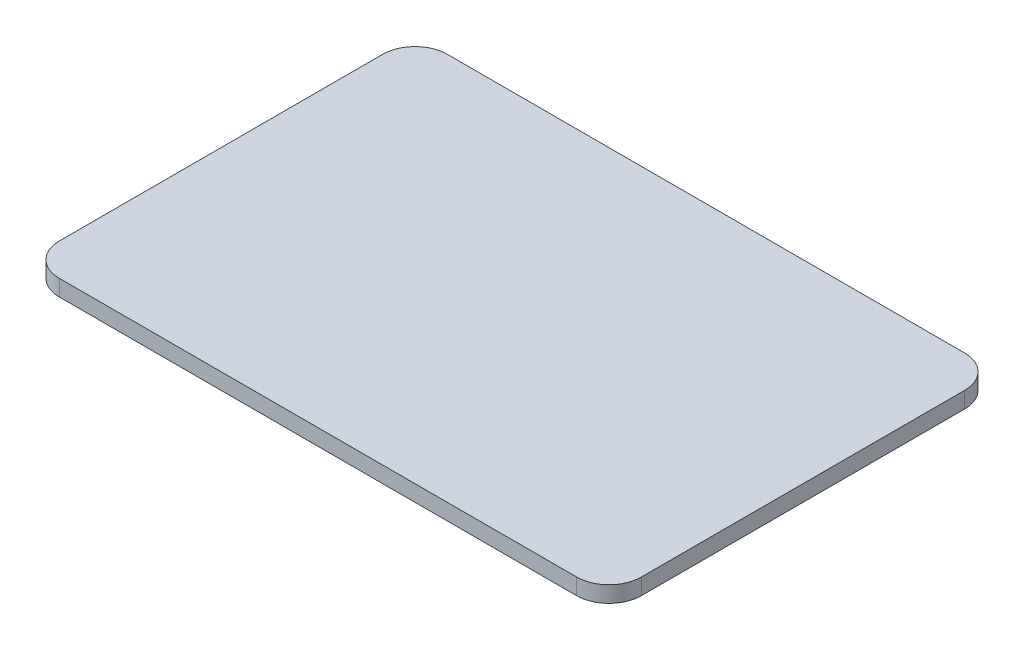
ISO-10303-21;
HEADER;
FILE_DESCRIPTION(('STEP AP214'),'2;1');
FILE_NAME('part.step','',(''),(''),'','','');
FILE_SCHEMA(('AUTOMOTIVE_DESIGN { 1 0 10303 214 1 1 1 1 }'));
ENDSEC;
DATA;
#1=APPLICATION_CONTEXT('core data for automotive mechanical design processes');
#2=APPLICATION_PROTOCOL_DEFINITION('international standard','automotive_design',2000,#1);
#3=PRODUCT_CONTEXT('',#1,'mechanical');
#4=PRODUCT('Part','Part','',(#3));
#5=PRODUCT_RELATED_PRODUCT_CATEGORY('part','',(#4));
#6=PRODUCT_DEFINITION_FORMATION('','',#4);
#7=PRODUCT_DEFINITION_CONTEXT('part definition',#1,'design');
#8=PRODUCT_DEFINITION('design','',#6,#7);
#9=PRODUCT_DEFINITION_SHAPE('','',#8);
#10=(LENGTH_UNIT() NAMED_UNIT(*) SI_UNIT(.MILLI.,.METRE.));
#11=(NAMED_UNIT(*) PLANE_ANGLE_UNIT() SI_UNIT($,.RADIAN.));
#12=(NAMED_UNIT(*) SI_UNIT($,.STERADIAN.) SOLID_ANGLE_UNIT());
#13=UNCERTAINTY_MEASURE_WITH_UNIT(LENGTH_MEASURE(1.E-05),#10,'distance_accuracy_value','');
#14=(GEOMETRIC_REPRESENTATION_CONTEXT(3) GLOBAL_UNCERTAINTY_ASSIGNED_CONTEXT((#13)) GLOBAL_UNIT_ASSIGNED_CONTEXT((#10,
#11,#12)) REPRESENTATION_CONTEXT('',''));
#15=CARTESIAN_POINT('',(0.,0.,0.));
#16=DIRECTION('',(0.,0.,1.));
#17=DIRECTION('',(1.,0.,0.));
#18=AXIS2_PLACEMENT_3D('',#15,#16,#17);
#19=CARTESIAN_POINT('',(80.,5.,-50.));
#20=DIRECTION('',(0.,-1.,0.));
#21=DIRECTION('',(0.,0.,-1.));
#22=AXIS2_PLACEMENT_3D('',#19,#20,#21);
#23=CYLINDRICAL_SURFACE('',#22,10.);
#24=DIRECTION('',(0.,-1.,0.));
#25=VECTOR('',#24,1.);
#26=CARTESIAN_POINT('',(80.,5.,-60.));
#27=LINE('',#26,#25);
#28=CARTESIAN_POINT('',(79.9999999999999,5.,-60.));
#29=VERTEX_POINT('',#28);
#30=CARTESIAN_POINT('',(79.9999999999999,0.,-60.));
#31=VERTEX_POINT('',#30);
#32=EDGE_CURVE('E150',#29,#31,#27,.T.);
#33=ORIENTED_EDGE('',*,*,#32,.F.);
#34=CARTESIAN_POINT('',(80.,5.,-50.));
#35=DIRECTION('',(0.,-1.,0.));
#36=DIRECTION('',(0.,0.,-1.));
#37=AXIS2_PLACEMENT_3D('',#34,#35,#36);
#38=CIRCLE('',#37,10.);
#39=CARTESIAN_POINT('',(90.,5.,-50.));
#40=VERTEX_POINT('',#39);
#41=EDGE_CURVE('E40',#40,#29,#38,.F.);
#42=ORIENTED_EDGE('',*,*,#41,.F.);
#43=DIRECTION('',(0.,-1.,0.));
#44=VECTOR('',#43,1.);
#45=CARTESIAN_POINT('',(90.,5.,-50.));
#46=LINE('',#45,#44);
#47=CARTESIAN_POINT('',(90.,0.,-50.));
#48=VERTEX_POINT('',#47);
#49=EDGE_CURVE('E153',#48,#40,#46,.F.);
#50=ORIENTED_EDGE('',*,*,#49,.F.);
#51=CARTESIAN_POINT('',(80.,0.,-50.));
#52=DIRECTION('',(0.,-1.,0.));
#53=DIRECTION('',(0.,0.,-1.));
#54=AXIS2_PLACEMENT_3D('',#51,#52,#53);
#55=CIRCLE('',#54,10.);
#56=EDGE_CURVE('E11',#31,#48,#55,.T.);
#57=ORIENTED_EDGE('',*,*,#56,.F.);
#58=EDGE_LOOP('',(#33,#42,#50,#57));
#59=FACE_BOUND('',#58,.T.);
#60=ADVANCED_FACE('F33',(#59),#23,.T.);
#61=CARTESIAN_POINT('',(80.,5.,50.));
#62=DIRECTION('',(0.,-1.,0.));
#63=DIRECTION('',(0.,0.,-1.));
#64=AXIS2_PLACEMENT_3D('',#61,#62,#63);
#65=CYLINDRICAL_SURFACE('',#64,10.);
#66=DIRECTION('',(0.,-1.,0.));
#67=VECTOR('',#66,1.);
#68=CARTESIAN_POINT('',(90.,5.,50.));
#69=LINE('',#68,#67);
#70=CARTESIAN_POINT('',(90.,5.,50.));
#71=VERTEX_POINT('',#70);
#72=CARTESIAN_POINT('',(90.,0.,50.));
#73=VERTEX_POINT('',#72);
#74=EDGE_CURVE('E140',#71,#73,#69,.T.);
#75=ORIENTED_EDGE('',*,*,#74,.F.);
#76=CARTESIAN_POINT('',(80.,5.,50.));
#77=DIRECTION('',(0.,-1.,0.));
#78=DIRECTION('',(0.,0.,-1.));
#79=AXIS2_PLACEMENT_3D('',#76,#77,#78);
#80=CIRCLE('',#79,10.);
#81=CARTESIAN_POINT('',(79.9999999999999,5.,60.));
#82=VERTEX_POINT('',#81);
#83=EDGE_CURVE('E146',#82,#71,#80,.F.);
#84=ORIENTED_EDGE('',*,*,#83,.F.);
#85=DIRECTION('',(0.,-1.,0.));
#86=VECTOR('',#85,1.);
#87=CARTESIAN_POINT('',(80.,5.,60.));
#88=LINE('',#87,#86);
#89=CARTESIAN_POINT('',(79.9999999999999,0.,60.));
#90=VERTEX_POINT('',#89);
#91=EDGE_CURVE('E143',#90,#82,#88,.F.);
#92=ORIENTED_EDGE('',*,*,#91,.F.);
#93=CARTESIAN_POINT('',(80.,0.,50.));
#94=DIRECTION('',(0.,-1.,0.));
#95=DIRECTION('',(0.,0.,-1.));
#96=AXIS2_PLACEMENT_3D('',#93,#94,#95);
#97=CIRCLE('',#96,10.);
#98=EDGE_CURVE('E148',#73,#90,#97,.T.);
#99=ORIENTED_EDGE('',*,*,#98,.F.);
#100=EDGE_LOOP('',(#75,#84,#92,#99));
#101=FACE_BOUND('',#100,.T.);
#102=ADVANCED_FACE('F173',(#101),#65,.T.);
#103=CARTESIAN_POINT('',(-80.,5.,50.));
#104=DIRECTION('',(0.,-1.,0.));
#105=DIRECTION('',(0.,0.,-1.));
#106=AXIS2_PLACEMENT_3D('',#103,#104,#105);
#107=CYLINDRICAL_SURFACE('',#106,10.);
#108=DIRECTION('',(0.,-1.,0.));
#109=VECTOR('',#108,1.);
#110=CARTESIAN_POINT('',(-80.,5.,60.));
#111=LINE('',#110,#109);
#112=CARTESIAN_POINT('',(-80.,5.,60.));
#113=VERTEX_POINT('',#112);
#114=CARTESIAN_POINT('',(-80.,0.,60.));
#115=VERTEX_POINT('',#114);
#116=EDGE_CURVE('E105',#113,#115,#111,.T.);
#117=ORIENTED_EDGE('',*,*,#116,.F.);
#118=CARTESIAN_POINT('',(-80.,5.,50.));
#119=DIRECTION('',(0.,-1.,0.));
#120=DIRECTION('',(0.,0.,-1.));
#121=AXIS2_PLACEMENT_3D('',#118,#119,#120);
#122=CIRCLE('',#121,10.);
#123=CARTESIAN_POINT('',(-90.,5.,50.));
#124=VERTEX_POINT('',#123);
#125=EDGE_CURVE('E137',#124,#113,#122,.F.);
#126=ORIENTED_EDGE('',*,*,#125,.F.);
#127=DIRECTION('',(0.,-1.,0.));
#128=VECTOR('',#127,1.);
#129=CARTESIAN_POINT('',(-90.,5.,50.));
#130=LINE('',#129,#128);
#131=CARTESIAN_POINT('',(-90.,0.,50.));
#132=VERTEX_POINT('',#131);
#133=EDGE_CURVE('E135',#132,#124,#130,.F.);
#134=ORIENTED_EDGE('',*,*,#133,.F.);
#135=CARTESIAN_POINT('',(-80.,0.,50.));
#136=DIRECTION('',(0.,-1.,0.));
#137=DIRECTION('',(0.,0.,-1.));
#138=AXIS2_PLACEMENT_3D('',#135,#136,#137);
#139=CIRCLE('',#138,10.);
#140=EDGE_CURVE('E119',#115,#132,#139,.T.);
#141=ORIENTED_EDGE('',*,*,#140,.F.);
#142=EDGE_LOOP('',(#117,#126,#134,#141));
#143=FACE_BOUND('',#142,.T.);
#144=ADVANCED_FACE('F179',(#143),#107,.T.);
#145=CARTESIAN_POINT('',(-80.,5.,-50.));
#146=DIRECTION('',(0.,-1.,0.));
#147=DIRECTION('',(0.,0.,-1.));
#148=AXIS2_PLACEMENT_3D('',#145,#146,#147);
#149=CYLINDRICAL_SURFACE('',#148,10.);
#150=DIRECTION('',(0.,-1.,0.));
#151=VECTOR('',#150,1.);
#152=CARTESIAN_POINT('',(-90.,5.,-50.));
#153=LINE('',#152,#151);
#154=CARTESIAN_POINT('',(-90.,5.,-50.));
#155=VERTEX_POINT('',#154);
#156=CARTESIAN_POINT('',(-90.,0.,-50.));
#157=VERTEX_POINT('',#156);
#158=EDGE_CURVE('E100',#155,#157,#153,.T.);
#159=ORIENTED_EDGE('',*,*,#158,.F.);
#160=CARTESIAN_POINT('',(-80.,5.,-50.));
#161=DIRECTION('',(0.,-1.,0.));
#162=DIRECTION('',(0.,0.,-1.));
#163=AXIS2_PLACEMENT_3D('',#160,#161,#162);
#164=CIRCLE('',#163,10.);
#165=CARTESIAN_POINT('',(-80.,5.,-60.));
#166=VERTEX_POINT('',#165);
#167=EDGE_CURVE('E106',#166,#155,#164,.F.);
#168=ORIENTED_EDGE('',*,*,#167,.F.);
#169=DIRECTION('',(0.,-1.,0.));
#170=VECTOR('',#169,1.);
#171=CARTESIAN_POINT('',(-80.,5.,-60.));
#172=LINE('',#171,#170);
#173=CARTESIAN_POINT('',(-80.,0.,-60.));
#174=VERTEX_POINT('',#173);
#175=EDGE_CURVE('E103',#174,#166,#172,.F.);
#176=ORIENTED_EDGE('',*,*,#175,.F.);
#177=CARTESIAN_POINT('',(-80.,0.,-50.));
#178=DIRECTION('',(0.,-1.,0.));
#179=DIRECTION('',(0.,0.,-1.));
#180=AXIS2_PLACEMENT_3D('',#177,#178,#179);
#181=CIRCLE('',#180,10.);
#182=EDGE_CURVE('E96',#157,#174,#181,.T.);
#183=ORIENTED_EDGE('',*,*,#182,.F.);
#184=EDGE_LOOP('',(#159,#168,#176,#183));
#185=FACE_BOUND('',#184,.T.);
#186=ADVANCED_FACE('F98',(#185),#149,.T.);
#187=CARTESIAN_POINT('',(90.,5.,60.));
#188=DIRECTION('',(-1.,0.,0.));
#189=DIRECTION('',(0.,0.,1.));
#190=AXIS2_PLACEMENT_3D('',#187,#188,#189);
#191=PLANE('',#190);
#192=DIRECTION('',(0.,0.,-1.));
#193=VECTOR('',#192,1.);
#194=CARTESIAN_POINT('',(90.,0.,60.));
#195=LINE('',#194,#193);
#196=EDGE_CURVE('E127',#73,#48,#195,.T.);
#197=ORIENTED_EDGE('',*,*,#196,.T.);
#198=ORIENTED_EDGE('',*,*,#49,.T.);
#199=DIRECTION('',(0.,0.,-1.));
#200=VECTOR('',#199,1.);
#201=CARTESIAN_POINT('',(90.,5.,60.));
#202=LINE('',#201,#200);
#203=EDGE_CURVE('E125',#71,#40,#202,.T.);
#204=ORIENTED_EDGE('',*,*,#203,.F.);
#205=ORIENTED_EDGE('',*,*,#74,.T.);
#206=EDGE_LOOP('',(#197,#198,#204,#205));
#207=FACE_BOUND('',#206,.T.);
#208=ADVANCED_FACE('F169',(#207),#191,.F.);
#209=CARTESIAN_POINT('',(-90.,5.,-60.));
#210=DIRECTION('',(0.,0.,1.));
#211=DIRECTION('',(1.,0.,0.));
#212=AXIS2_PLACEMENT_3D('',#209,#210,#211);
#213=PLANE('',#212);
#214=DIRECTION('',(-1.,0.,0.));
#215=VECTOR('',#214,1.);
#216=CARTESIAN_POINT('',(-90.,5.,-60.));
#217=LINE('',#216,#215);
#218=EDGE_CURVE('E158',#29,#166,#217,.T.);
#219=ORIENTED_EDGE('',*,*,#218,.F.);
#220=ORIENTED_EDGE('',*,*,#32,.T.);
#221=DIRECTION('',(-1.,0.,0.));
#222=VECTOR('',#221,1.);
#223=CARTESIAN_POINT('',(-90.,0.,-60.));
#224=LINE('',#223,#222);
#225=EDGE_CURVE('E122',#31,#174,#224,.T.);
#226=ORIENTED_EDGE('',*,*,#225,.T.);
#227=ORIENTED_EDGE('',*,*,#175,.T.);
#228=EDGE_LOOP('',(#219,#220,#226,#227));
#229=FACE_BOUND('',#228,.T.);
#230=ADVANCED_FACE('F161',(#229),#213,.F.);
#231=CARTESIAN_POINT('',(-90.,5.,60.));
#232=DIRECTION('',(1.,0.,0.));
#233=DIRECTION('',(0.,0.,-1.));
#234=AXIS2_PLACEMENT_3D('',#231,#232,#233);
#235=PLANE('',#234);
#236=DIRECTION('',(0.,0.,1.));
#237=VECTOR('',#236,1.);
#238=CARTESIAN_POINT('',(-90.,0.,60.));
#239=LINE('',#238,#237);
#240=EDGE_CURVE('E112',#157,#132,#239,.T.);
#241=ORIENTED_EDGE('',*,*,#240,.T.);
#242=ORIENTED_EDGE('',*,*,#133,.T.);
#243=DIRECTION('',(0.,0.,1.));
#244=VECTOR('',#243,1.);
#245=CARTESIAN_POINT('',(-90.,5.,60.));
#246=LINE('',#245,#244);
#247=EDGE_CURVE('E114',#155,#124,#246,.T.);
#248=ORIENTED_EDGE('',*,*,#247,.F.);
#249=ORIENTED_EDGE('',*,*,#158,.T.);
#250=EDGE_LOOP('',(#241,#242,#248,#249));
#251=FACE_BOUND('',#250,.T.);
#252=ADVANCED_FACE('F110',(#251),#235,.F.);
#253=CARTESIAN_POINT('',(-90.,5.,60.));
#254=DIRECTION('',(0.,0.,-1.));
#255=DIRECTION('',(-1.,0.,0.));
#256=AXIS2_PLACEMENT_3D('',#253,#254,#255);
#257=PLANE('',#256);
#258=DIRECTION('',(1.,0.,0.));
#259=VECTOR('',#258,1.);
#260=CARTESIAN_POINT('',(-90.,0.,60.));
#261=LINE('',#260,#259);
#262=EDGE_CURVE('E121',#115,#90,#261,.T.);
#263=ORIENTED_EDGE('',*,*,#262,.T.);
#264=ORIENTED_EDGE('',*,*,#91,.T.);
#265=DIRECTION('',(1.,0.,0.));
#266=VECTOR('',#265,1.);
#267=CARTESIAN_POINT('',(-90.,5.,60.));
#268=LINE('',#267,#266);
#269=EDGE_CURVE('E115',#113,#82,#268,.T.);
#270=ORIENTED_EDGE('',*,*,#269,.F.);
#271=ORIENTED_EDGE('',*,*,#116,.T.);
#272=EDGE_LOOP('',(#263,#264,#270,#271));
#273=FACE_BOUND('',#272,.T.);
#274=ADVANCED_FACE('F176',(#273),#257,.F.);
#275=CARTESIAN_POINT('',(0.,5.,0.));
#276=DIRECTION('',(0.,-1.,0.));
#277=DIRECTION('',(0.,0.,-1.));
#278=AXIS2_PLACEMENT_3D('',#275,#276,#277);
#279=PLANE('',#278);
#280=ORIENTED_EDGE('',*,*,#203,.T.);
#281=ORIENTED_EDGE('',*,*,#41,.T.);
#282=ORIENTED_EDGE('',*,*,#218,.T.);
#283=ORIENTED_EDGE('',*,*,#167,.T.);
#284=ORIENTED_EDGE('',*,*,#247,.T.);
#285=ORIENTED_EDGE('',*,*,#125,.T.);
#286=ORIENTED_EDGE('',*,*,#269,.T.);
#287=ORIENTED_EDGE('',*,*,#83,.T.);
#288=EDGE_LOOP('',(#280,#281,#282,#283,#284,#285,#286,#287));
#289=FACE_BOUND('',#288,.T.);
#290=ADVANCED_FACE('F156',(#289),#279,.F.);
#291=CARTESIAN_POINT('',(0.,0.,0.));
#292=DIRECTION('',(0.,-1.,0.));
#293=DIRECTION('',(0.,0.,-1.));
#294=AXIS2_PLACEMENT_3D('',#291,#292,#293);
#295=PLANE('',#294);
#296=ORIENTED_EDGE('',*,*,#225,.F.);
#297=ORIENTED_EDGE('',*,*,#56,.T.);
#298=ORIENTED_EDGE('',*,*,#196,.F.);
#299=ORIENTED_EDGE('',*,*,#98,.T.);
#300=ORIENTED_EDGE('',*,*,#262,.F.);
#301=ORIENTED_EDGE('',*,*,#140,.T.);
#302=ORIENTED_EDGE('',*,*,#240,.F.);
#303=ORIENTED_EDGE('',*,*,#182,.T.);
#304=EDGE_LOOP('',(#296,#297,#298,#299,#300,#301,#302,#303));
#305=FACE_BOUND('',#304,.T.);
#306=ADVANCED_FACE('F117',(#305),#295,.T.);
#307=CLOSED_SHELL('',(#60,#102,#144,#186,#208,#230,#252,#274,#290,#306));
#308=MANIFOLD_SOLID_BREP('B2',#307);
#309=ADVANCED_BREP_SHAPE_REPRESENTATION('',(#18,#308),#14);
#310=SHAPE_DEFINITION_REPRESENTATION(#9,#309);
ENDSEC;
END-ISO-10303-21;
